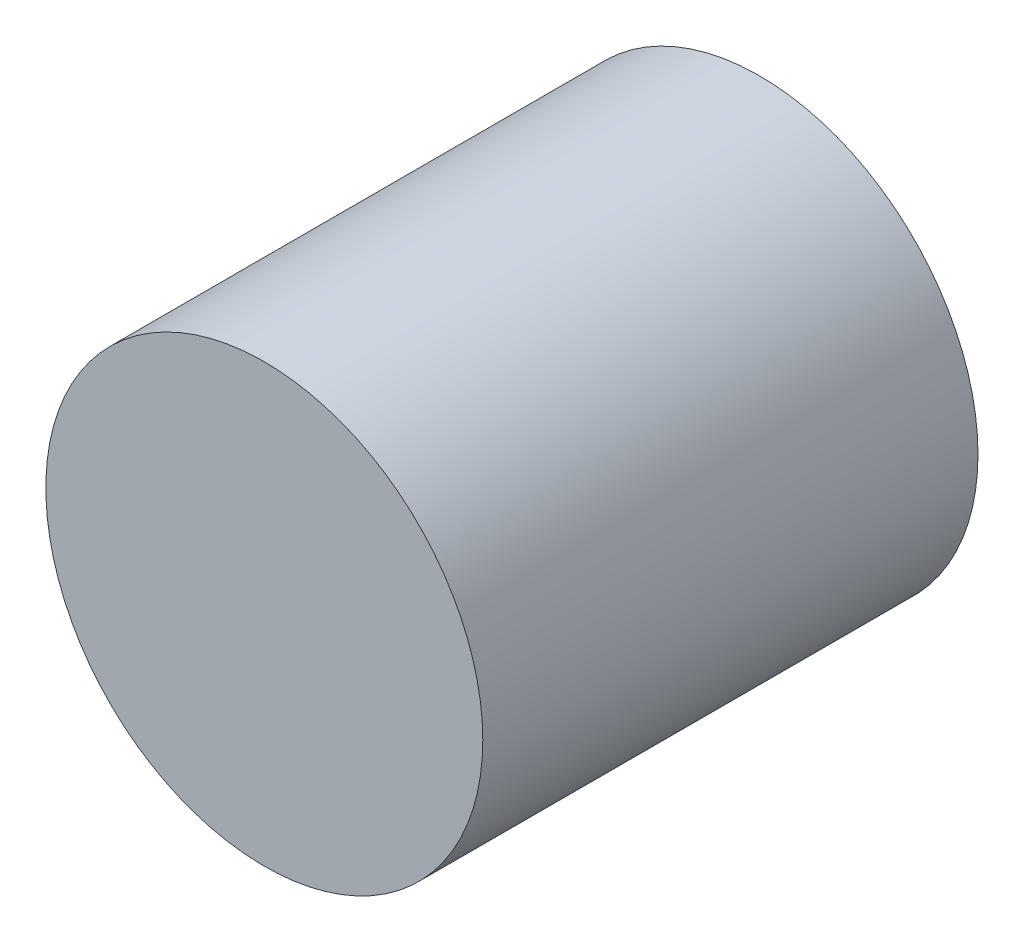
ISO-10303-21;
HEADER;
FILE_DESCRIPTION(('STEP AP214'),'2;1');
FILE_NAME('part.step','',(''),(''),'','','');
FILE_SCHEMA(('AUTOMOTIVE_DESIGN { 1 0 10303 214 1 1 1 1 }'));
ENDSEC;
DATA;
#1=APPLICATION_CONTEXT('core data for automotive mechanical design processes');
#2=APPLICATION_PROTOCOL_DEFINITION('international standard','automotive_design',2000,#1);
#3=PRODUCT_CONTEXT('',#1,'mechanical');
#4=PRODUCT('Part','Part','',(#3));
#5=PRODUCT_RELATED_PRODUCT_CATEGORY('part','',(#4));
#6=PRODUCT_DEFINITION_FORMATION('','',#4);
#7=PRODUCT_DEFINITION_CONTEXT('part definition',#1,'design');
#8=PRODUCT_DEFINITION('design','',#6,#7);
#9=PRODUCT_DEFINITION_SHAPE('','',#8);
#10=(LENGTH_UNIT() NAMED_UNIT(*) SI_UNIT(.MILLI.,.METRE.));
#11=(NAMED_UNIT(*) PLANE_ANGLE_UNIT() SI_UNIT($,.RADIAN.));
#12=(NAMED_UNIT(*) SI_UNIT($,.STERADIAN.) SOLID_ANGLE_UNIT());
#13=UNCERTAINTY_MEASURE_WITH_UNIT(LENGTH_MEASURE(1.E-05),#10,'distance_accuracy_value','');
#14=(GEOMETRIC_REPRESENTATION_CONTEXT(3) GLOBAL_UNCERTAINTY_ASSIGNED_CONTEXT((#13)) GLOBAL_UNIT_ASSIGNED_CONTEXT((#10,
#11,#12)) REPRESENTATION_CONTEXT('',''));
#15=CARTESIAN_POINT('',(0.,0.,0.));
#16=DIRECTION('',(0.,0.,1.));
#17=DIRECTION('',(1.,0.,0.));
#18=AXIS2_PLACEMENT_3D('',#15,#16,#17);
#19=CARTESIAN_POINT('',(0.,0.,170.));
#20=DIRECTION('',(0.,0.,-1.));
#21=DIRECTION('',(-1.,0.,0.));
#22=AXIS2_PLACEMENT_3D('',#19,#20,#21);
#23=CYLINDRICAL_SURFACE('',#22,75.);
#24=CARTESIAN_POINT('',(0.,0.,170.));
#25=DIRECTION('',(0.,0.,1.));
#26=DIRECTION('',(1.,0.,0.));
#27=AXIS2_PLACEMENT_3D('',#24,#25,#26);
#28=CIRCLE('',#27,75.);
#29=CARTESIAN_POINT('',(75.,0.,170.));
#30=VERTEX_POINT('',#29);
#31=EDGE_CURVE('E10',#30,#30,#28,.T.);
#32=ORIENTED_EDGE('',*,*,#31,.F.);
#33=EDGE_LOOP('',(#32));
#34=FACE_BOUND('',#33,.T.);
#35=CARTESIAN_POINT('',(0.,0.,0.));
#36=DIRECTION('',(0.,0.,1.));
#37=DIRECTION('',(1.,0.,0.));
#38=AXIS2_PLACEMENT_3D('',#35,#36,#37);
#39=CIRCLE('',#38,75.);
#40=CARTESIAN_POINT('',(75.,0.,0.));
#41=VERTEX_POINT('',#40);
#42=EDGE_CURVE('E42',#41,#41,#39,.T.);
#43=ORIENTED_EDGE('',*,*,#42,.T.);
#44=EDGE_LOOP('',(#43));
#45=FACE_BOUND('',#44,.T.);
#46=ADVANCED_FACE('F39',(#34,#45),#23,.T.);
#47=CARTESIAN_POINT('',(0.,0.,170.));
#48=DIRECTION('',(0.,0.,1.));
#49=DIRECTION('',(1.,0.,0.));
#50=AXIS2_PLACEMENT_3D('',#47,#48,#49);
#51=PLANE('',#50);
#52=ORIENTED_EDGE('',*,*,#31,.T.);
#53=EDGE_LOOP('',(#52));
#54=FACE_BOUND('',#53,.T.);
#55=ADVANCED_FACE('F56',(#54),#51,.T.);
#56=CARTESIAN_POINT('',(0.,0.,0.));
#57=DIRECTION('',(0.,0.,1.));
#58=DIRECTION('',(1.,0.,0.));
#59=AXIS2_PLACEMENT_3D('',#56,#57,#58);
#60=PLANE('',#59);
#61=ORIENTED_EDGE('',*,*,#42,.F.);
#62=EDGE_LOOP('',(#61));
#63=FACE_BOUND('',#62,.T.);
#64=ADVANCED_FACE('F54',(#63),#60,.F.);
#65=CLOSED_SHELL('',(#46,#55,#64));
#66=MANIFOLD_SOLID_BREP('B2',#65);
#67=ADVANCED_BREP_SHAPE_REPRESENTATION('',(#18,#66),#14);
#68=SHAPE_DEFINITION_REPRESENTATION(#9,#67);
ENDSEC;
END-ISO-10303-21;
